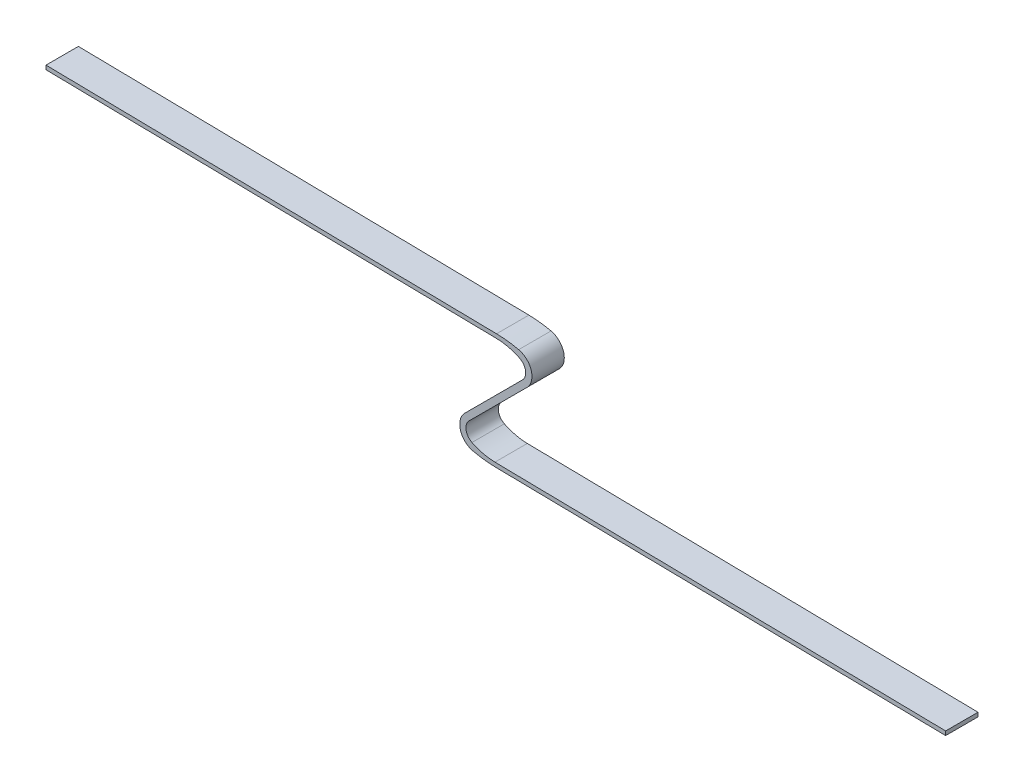
ISO-10303-21;
HEADER;
FILE_DESCRIPTION(('STEP AP214'),'2;1');
FILE_NAME('part.step','',(''),(''),'','','');
FILE_SCHEMA(('AUTOMOTIVE_DESIGN { 1 0 10303 214 1 1 1 1 }'));
ENDSEC;
DATA;
#1=APPLICATION_CONTEXT('core data for automotive mechanical design processes');
#2=APPLICATION_PROTOCOL_DEFINITION('international standard','automotive_design',2000,#1);
#3=PRODUCT_CONTEXT('',#1,'mechanical');
#4=PRODUCT('Part','Part','',(#3));
#5=PRODUCT_RELATED_PRODUCT_CATEGORY('part','',(#4));
#6=PRODUCT_DEFINITION_FORMATION('','',#4);
#7=PRODUCT_DEFINITION_CONTEXT('part definition',#1,'design');
#8=PRODUCT_DEFINITION('design','',#6,#7);
#9=PRODUCT_DEFINITION_SHAPE('','',#8);
#10=(LENGTH_UNIT() NAMED_UNIT(*) SI_UNIT(.MILLI.,.METRE.));
#11=(NAMED_UNIT(*) PLANE_ANGLE_UNIT() SI_UNIT($,.RADIAN.));
#12=(NAMED_UNIT(*) SI_UNIT($,.STERADIAN.) SOLID_ANGLE_UNIT());
#13=UNCERTAINTY_MEASURE_WITH_UNIT(LENGTH_MEASURE(1.E-05),#10,'distance_accuracy_value','');
#14=(GEOMETRIC_REPRESENTATION_CONTEXT(3) GLOBAL_UNCERTAINTY_ASSIGNED_CONTEXT((#13)) GLOBAL_UNIT_ASSIGNED_CONTEXT((#10,
#11,#12)) REPRESENTATION_CONTEXT('',''));
#15=CARTESIAN_POINT('',(0.,0.,0.));
#16=DIRECTION('',(0.,0.,1.));
#17=DIRECTION('',(1.,0.,0.));
#18=AXIS2_PLACEMENT_3D('',#15,#16,#17);
#19=CARTESIAN_POINT('',(3.53500880090639,7.17660872401751,29.5000000000005));
#20=DIRECTION('',(0.,0.,-1.));
#21=DIRECTION('',(-1.,0.,0.));
#22=AXIS2_PLACEMENT_3D('',#19,#20,#21);
#23=CYLINDRICAL_SURFACE('',#22,1.99999999999999);
#24=CARTESIAN_POINT('',(3.53500880090639,7.17660872401751,23.5000000000005));
#25=DIRECTION('',(0.,0.,-1.));
#26=DIRECTION('',(1.,0.,0.));
#27=AXIS2_PLACEMENT_3D('',#24,#25,#26);
#28=CIRCLE('',#27,1.99999999999999);
#29=CARTESIAN_POINT('',(4.41876100113213,8.97076090502004,23.5000000000005));
#30=VERTEX_POINT('',#29);
#31=CARTESIAN_POINT('',(4.94922236327948,5.76239516164443,23.5000000000005));
#32=VERTEX_POINT('',#31);
#33=EDGE_CURVE('E181',#30,#32,#28,.T.);
#34=ORIENTED_EDGE('',*,*,#33,.T.);
#35=DIRECTION('',(0.,0.,-1.));
#36=VECTOR('',#35,1.);
#37=CARTESIAN_POINT('',(4.94922236327948,5.76239516164443,29.5000000000005));
#38=LINE('',#37,#36);
#39=CARTESIAN_POINT('',(4.94922236327948,5.76239516164443,29.5000000000005));
#40=VERTEX_POINT('',#39);
#41=EDGE_CURVE('E11',#40,#32,#38,.T.);
#42=ORIENTED_EDGE('',*,*,#41,.F.);
#43=CARTESIAN_POINT('',(3.53500880090639,7.17660872401751,29.5000000000005));
#44=DIRECTION('',(0.,0.,-1.));
#45=DIRECTION('',(1.,0.,0.));
#46=AXIS2_PLACEMENT_3D('',#43,#44,#45);
#47=CIRCLE('',#46,1.99999999999999);
#48=CARTESIAN_POINT('',(4.41876100113213,8.97076090502004,29.5000000000005));
#49=VERTEX_POINT('',#48);
#50=EDGE_CURVE('E211',#49,#40,#47,.T.);
#51=ORIENTED_EDGE('',*,*,#50,.F.);
#52=DIRECTION('',(0.,0.,-1.));
#53=VECTOR('',#52,1.);
#54=CARTESIAN_POINT('',(4.41876100113213,8.97076090502004,29.5000000000005));
#55=LINE('',#54,#53);
#56=EDGE_CURVE('E177',#49,#30,#55,.T.);
#57=ORIENTED_EDGE('',*,*,#56,.T.);
#58=EDGE_LOOP('',(#34,#42,#51,#57));
#59=FACE_BOUND('',#58,.T.);
#60=ADVANCED_FACE('F37',(#59),#23,.F.);
#61=CARTESIAN_POINT('',(4.94922236327948,5.76239516164443,29.5000000000005));
#62=DIRECTION('',(0.707106781186548,-0.707106781186547,0.));
#63=DIRECTION('',(0.707106781186547,0.707106781186548,0.));
#64=AXIS2_PLACEMENT_3D('',#61,#62,#63);
#65=PLANE('',#64);
#66=DIRECTION('',(-0.707106781186547,-0.707106781186548,0.));
#67=VECTOR('',#66,1.);
#68=CARTESIAN_POINT('',(4.94922236327948,5.76239516164443,23.5000000000005));
#69=LINE('',#68,#67);
#70=CARTESIAN_POINT('',(-5.76239516164399,-4.94922236327907,23.5000000000005));
#71=VERTEX_POINT('',#70);
#72=EDGE_CURVE('E184',#32,#71,#69,.T.);
#73=ORIENTED_EDGE('',*,*,#72,.T.);
#74=DIRECTION('',(0.,0.,-1.));
#75=VECTOR('',#74,1.);
#76=CARTESIAN_POINT('',(-5.76239516164399,-4.94922236327907,29.5000000000005));
#77=LINE('',#76,#75);
#78=CARTESIAN_POINT('',(-5.76239516164399,-4.94922236327907,29.5000000000005));
#79=VERTEX_POINT('',#78);
#80=EDGE_CURVE('E45',#79,#71,#77,.T.);
#81=ORIENTED_EDGE('',*,*,#80,.F.);
#82=DIRECTION('',(-0.707106781186547,-0.707106781186548,0.));
#83=VECTOR('',#82,1.);
#84=CARTESIAN_POINT('',(4.94922236327948,5.76239516164443,29.5000000000005));
#85=LINE('',#84,#83);
#86=EDGE_CURVE('E120',#40,#79,#85,.T.);
#87=ORIENTED_EDGE('',*,*,#86,.F.);
#88=ORIENTED_EDGE('',*,*,#41,.T.);
#89=EDGE_LOOP('',(#73,#81,#87,#88));
#90=FACE_BOUND('',#89,.T.);
#91=ADVANCED_FACE('F309',(#90),#65,.F.);
#92=CARTESIAN_POINT('',(-3.53500880090639,-7.17660872401666,29.5000000000005));
#93=DIRECTION('',(0.,0.,-1.));
#94=DIRECTION('',(-1.,0.,0.));
#95=AXIS2_PLACEMENT_3D('',#92,#93,#94);
#96=CYLINDRICAL_SURFACE('',#95,3.14999999999997);
#97=CARTESIAN_POINT('',(-3.53500880090639,-7.17660872401666,23.5000000000005));
#98=DIRECTION('',(0.,0.,1.));
#99=DIRECTION('',(1.,0.,0.));
#100=AXIS2_PLACEMENT_3D('',#97,#98,#99);
#101=CIRCLE('',#100,3.14999999999997);
#102=CARTESIAN_POINT('',(-4.23868319076121,-10.2470064756219,23.5000000000005));
#103=VERTEX_POINT('',#102);
#104=EDGE_CURVE('E186',#71,#103,#101,.T.);
#105=ORIENTED_EDGE('',*,*,#104,.T.);
#106=DIRECTION('',(0.,0.,-1.));
#107=VECTOR('',#106,1.);
#108=CARTESIAN_POINT('',(-4.23868319076121,-10.2470064756219,29.5000000000005));
#109=LINE('',#108,#107);
#110=CARTESIAN_POINT('',(-4.23868319076121,-10.2470064756219,29.5000000000005));
#111=VERTEX_POINT('',#110);
#112=EDGE_CURVE('E242',#111,#103,#109,.T.);
#113=ORIENTED_EDGE('',*,*,#112,.F.);
#114=CARTESIAN_POINT('',(-3.53500880090639,-7.17660872401666,29.5000000000005));
#115=DIRECTION('',(0.,0.,1.));
#116=DIRECTION('',(1.,0.,0.));
#117=AXIS2_PLACEMENT_3D('',#114,#115,#116);
#118=CIRCLE('',#117,3.14999999999997);
#119=EDGE_CURVE('E250',#79,#111,#118,.T.);
#120=ORIENTED_EDGE('',*,*,#119,.F.);
#121=ORIENTED_EDGE('',*,*,#80,.T.);
#122=EDGE_LOOP('',(#105,#113,#120,#121));
#123=FACE_BOUND('',#122,.T.);
#124=ADVANCED_FACE('F248',(#123),#96,.T.);
#125=CARTESIAN_POINT('',(0.229090713078887,9.24758242345897,29.5000000000005));
#126=DIRECTION('',(0.,0.,-1.));
#127=DIRECTION('',(-1.,0.,0.));
#128=AXIS2_PLACEMENT_3D('',#125,#126,#127);
#129=CYLINDRICAL_SURFACE('',#128,20.);
#130=CARTESIAN_POINT('',(0.229090713078887,9.24758242345897,23.5000000000005));
#131=DIRECTION('',(0.,0.,1.));
#132=DIRECTION('',(1.,0.,0.));
#133=AXIS2_PLACEMENT_3D('',#130,#131,#132);
#134=CIRCLE('',#133,20.);
#135=CARTESIAN_POINT('',(-0.100471188172594,-10.749702116029,23.5000000000005));
#136=VERTEX_POINT('',#135);
#137=EDGE_CURVE('E188',#103,#136,#134,.T.);
#138=ORIENTED_EDGE('',*,*,#137,.T.);
#139=DIRECTION('',(0.,0.,-1.));
#140=VECTOR('',#139,1.);
#141=CARTESIAN_POINT('',(-0.100471188172594,-10.749702116029,29.5000000000005));
#142=LINE('',#141,#140);
#143=CARTESIAN_POINT('',(-0.100471188172594,-10.749702116029,29.5000000000005));
#144=VERTEX_POINT('',#143);
#145=EDGE_CURVE('E239',#144,#136,#142,.T.);
#146=ORIENTED_EDGE('',*,*,#145,.F.);
#147=CARTESIAN_POINT('',(0.229090713078887,9.24758242345897,29.5000000000005));
#148=DIRECTION('',(0.,0.,1.));
#149=DIRECTION('',(1.,0.,0.));
#150=AXIS2_PLACEMENT_3D('',#147,#148,#149);
#151=CIRCLE('',#150,20.);
#152=EDGE_CURVE('E268',#111,#144,#151,.T.);
#153=ORIENTED_EDGE('',*,*,#152,.F.);
#154=ORIENTED_EDGE('',*,*,#112,.T.);
#155=EDGE_LOOP('',(#138,#146,#153,#154));
#156=FACE_BOUND('',#155,.T.);
#157=ADVANCED_FACE('F259',(#156),#129,.T.);
#158=CARTESIAN_POINT('',(-0.100471188172594,-10.749702116029,29.5000000000005));
#159=DIRECTION('',(0.016478095062574,0.999864226974397,0.));
#160=DIRECTION('',(-0.999864226974397,0.016478095062574,0.));
#161=AXIS2_PLACEMENT_3D('',#158,#159,#160);
#162=PLANE('',#161);
#163=DIRECTION('',(0.999864226974397,-0.016478095062574,0.));
#164=VECTOR('',#163,1.);
#165=CARTESIAN_POINT('',(-0.100471188172594,-10.749702116029,23.5000000000005));
#166=LINE('',#165,#164);
#167=CARTESIAN_POINT('',(83.3503858679681,-12.1250000000082,23.5000000000005));
#168=VERTEX_POINT('',#167);
#169=EDGE_CURVE('E190',#136,#168,#166,.T.);
#170=ORIENTED_EDGE('',*,*,#169,.T.);
#171=DIRECTION('',(0.,0.,-1.));
#172=VECTOR('',#171,1.);
#173=CARTESIAN_POINT('',(83.3503858679681,-12.1250000000082,29.5000000000005));
#174=LINE('',#173,#172);
#175=CARTESIAN_POINT('',(83.3503858679681,-12.1250000000082,29.5000000000005));
#176=VERTEX_POINT('',#175);
#177=EDGE_CURVE('E236',#176,#168,#174,.T.);
#178=ORIENTED_EDGE('',*,*,#177,.F.);
#179=DIRECTION('',(0.999864226974397,-0.016478095062574,0.));
#180=VECTOR('',#179,1.);
#181=CARTESIAN_POINT('',(-0.100471188172594,-10.749702116029,29.5000000000005));
#182=LINE('',#181,#180);
#183=EDGE_CURVE('E265',#144,#176,#182,.T.);
#184=ORIENTED_EDGE('',*,*,#183,.F.);
#185=ORIENTED_EDGE('',*,*,#145,.T.);
#186=EDGE_LOOP('',(#170,#178,#184,#185));
#187=FACE_BOUND('',#186,.T.);
#188=ADVANCED_FACE('F263',(#187),#162,.F.);
#189=CARTESIAN_POINT('',(83.3503858679681,-12.1250000000082,29.5000000000005));
#190=DIRECTION('',(-1.,0.,0.));
#191=DIRECTION('',(0.,0.,1.));
#192=AXIS2_PLACEMENT_3D('',#189,#190,#191);
#193=PLANE('',#192);
#194=DIRECTION('',(0.,1.,0.));
#195=VECTOR('',#194,1.);
#196=CARTESIAN_POINT('',(83.3503858679681,-12.1250000000082,23.5000000000005));
#197=LINE('',#196,#195);
#198=CARTESIAN_POINT('',(83.3503858679681,-11.3750000000082,23.5000000000005));
#199=VERTEX_POINT('',#198);
#200=EDGE_CURVE('E192',#168,#199,#197,.T.);
#201=ORIENTED_EDGE('',*,*,#200,.T.);
#202=DIRECTION('',(0.,0.,-1.));
#203=VECTOR('',#202,1.);
#204=CARTESIAN_POINT('',(83.3503858679681,-11.3750000000082,29.5000000000005));
#205=LINE('',#204,#203);
#206=CARTESIAN_POINT('',(83.3503858679681,-11.3750000000082,29.5000000000005));
#207=VERTEX_POINT('',#206);
#208=EDGE_CURVE('E233',#207,#199,#205,.T.);
#209=ORIENTED_EDGE('',*,*,#208,.F.);
#210=DIRECTION('',(0.,1.,0.));
#211=VECTOR('',#210,1.);
#212=CARTESIAN_POINT('',(83.3503858679681,-12.1250000000082,29.5000000000005));
#213=LINE('',#212,#211);
#214=EDGE_CURVE('E267',#176,#207,#213,.T.);
#215=ORIENTED_EDGE('',*,*,#214,.F.);
#216=ORIENTED_EDGE('',*,*,#177,.T.);
#217=EDGE_LOOP('',(#201,#209,#215,#216));
#218=FACE_BOUND('',#217,.T.);
#219=ADVANCED_FACE('F322',(#218),#193,.F.);
#220=CARTESIAN_POINT('',(-0.164780950625868,-9.99864226975129,29.5000000000005));
#221=DIRECTION('',(-0.016478095062574,-0.999864226974397,0.));
#222=DIRECTION('',(0.999864226974397,-0.016478095062574,0.));
#223=AXIS2_PLACEMENT_3D('',#220,#221,#222);
#224=PLANE('',#223);
#225=DIRECTION('',(-0.999864226974397,0.016478095062574,0.));
#226=VECTOR('',#225,1.);
#227=CARTESIAN_POINT('',(-0.164780950625868,-9.99864226975129,23.5000000000005));
#228=LINE('',#227,#226);
#229=CARTESIAN_POINT('',(-0.164780950625871,-9.99864226975128,23.5000000000005));
#230=VERTEX_POINT('',#229);
#231=EDGE_CURVE('E194',#199,#230,#228,.T.);
#232=ORIENTED_EDGE('',*,*,#231,.T.);
#233=DIRECTION('',(0.,0.,-1.));
#234=VECTOR('',#233,1.);
#235=CARTESIAN_POINT('',(-0.164780950625871,-9.99864226975128,29.5000000000005));
#236=LINE('',#235,#234);
#237=CARTESIAN_POINT('',(-0.164780950625871,-9.99864226975128,29.5000000000005));
#238=VERTEX_POINT('',#237);
#239=EDGE_CURVE('E230',#238,#230,#236,.T.);
#240=ORIENTED_EDGE('',*,*,#239,.F.);
#241=DIRECTION('',(-0.999864226974397,0.016478095062574,0.));
#242=VECTOR('',#241,1.);
#243=CARTESIAN_POINT('',(-0.164780950625868,-9.99864226975129,29.5000000000005));
#244=LINE('',#243,#242);
#245=EDGE_CURVE('E270',#207,#238,#244,.T.);
#246=ORIENTED_EDGE('',*,*,#245,.F.);
#247=ORIENTED_EDGE('',*,*,#208,.T.);
#248=EDGE_LOOP('',(#232,#240,#246,#247));
#249=FACE_BOUND('',#248,.T.);
#250=ADVANCED_FACE('F325',(#249),#224,.F.);
#251=CARTESIAN_POINT('',(0.,4.21016101940819E-13,29.5000000000005));
#252=DIRECTION('',(0.,0.,-1.));
#253=DIRECTION('',(-1.,0.,0.));
#254=AXIS2_PLACEMENT_3D('',#251,#252,#253);
#255=CYLINDRICAL_SURFACE('',#254,10.0000000000077);
#256=CARTESIAN_POINT('',(0.,4.21016101940819E-13,23.5000000000005));
#257=DIRECTION('',(0.,0.,-1.));
#258=DIRECTION('',(1.,0.,0.));
#259=AXIS2_PLACEMENT_3D('',#256,#257,#258);
#260=CIRCLE('',#259,10.0000000000077);
#261=CARTESIAN_POINT('',(-4.41876100113213,-8.97076090501919,23.5000000000005));
#262=VERTEX_POINT('',#261);
#263=EDGE_CURVE('E196',#230,#262,#260,.T.);
#264=ORIENTED_EDGE('',*,*,#263,.T.);
#265=DIRECTION('',(0.,0.,-1.));
#266=VECTOR('',#265,1.);
#267=CARTESIAN_POINT('',(-4.41876100113213,-8.97076090501919,29.5000000000005));
#268=LINE('',#267,#266);
#269=CARTESIAN_POINT('',(-4.41876100113213,-8.97076090501919,29.5000000000005));
#270=VERTEX_POINT('',#269);
#271=EDGE_CURVE('E227',#270,#262,#268,.T.);
#272=ORIENTED_EDGE('',*,*,#271,.F.);
#273=CARTESIAN_POINT('',(0.,4.21016101940819E-13,29.5000000000005));
#274=DIRECTION('',(0.,0.,-1.));
#275=DIRECTION('',(1.,0.,0.));
#276=AXIS2_PLACEMENT_3D('',#273,#274,#275);
#277=CIRCLE('',#276,10.0000000000077);
#278=EDGE_CURVE('E276',#238,#270,#277,.T.);
#279=ORIENTED_EDGE('',*,*,#278,.F.);
#280=ORIENTED_EDGE('',*,*,#239,.T.);
#281=EDGE_LOOP('',(#264,#272,#279,#280));
#282=FACE_BOUND('',#281,.T.);
#283=ADVANCED_FACE('F329',(#282),#255,.F.);
#284=CARTESIAN_POINT('',(-3.53500880090639,-7.17660872401666,29.5000000000005));
#285=DIRECTION('',(0.,0.,-1.));
#286=DIRECTION('',(-1.,0.,0.));
#287=AXIS2_PLACEMENT_3D('',#284,#285,#286);
#288=CYLINDRICAL_SURFACE('',#287,1.99999999999999);
#289=CARTESIAN_POINT('',(-3.53500880090639,-7.17660872401666,23.5000000000005));
#290=DIRECTION('',(0.,0.,-1.));
#291=DIRECTION('',(1.,0.,0.));
#292=AXIS2_PLACEMENT_3D('',#289,#290,#291);
#293=CIRCLE('',#292,1.99999999999999);
#294=CARTESIAN_POINT('',(-4.94922236327947,-5.76239516164357,23.5000000000005));
#295=VERTEX_POINT('',#294);
#296=EDGE_CURVE('E198',#262,#295,#293,.T.);
#297=ORIENTED_EDGE('',*,*,#296,.T.);
#298=DIRECTION('',(0.,0.,-1.));
#299=VECTOR('',#298,1.);
#300=CARTESIAN_POINT('',(-4.94922236327947,-5.76239516164357,29.5000000000005));
#301=LINE('',#300,#299);
#302=CARTESIAN_POINT('',(-4.94922236327947,-5.76239516164357,29.5000000000005));
#303=VERTEX_POINT('',#302);
#304=EDGE_CURVE('E224',#303,#295,#301,.T.);
#305=ORIENTED_EDGE('',*,*,#304,.F.);
#306=CARTESIAN_POINT('',(-3.53500880090639,-7.17660872401666,29.5000000000005));
#307=DIRECTION('',(0.,0.,-1.));
#308=DIRECTION('',(1.,0.,0.));
#309=AXIS2_PLACEMENT_3D('',#306,#307,#308);
#310=CIRCLE('',#309,1.99999999999999);
#311=EDGE_CURVE('E278',#270,#303,#310,.T.);
#312=ORIENTED_EDGE('',*,*,#311,.F.);
#313=ORIENTED_EDGE('',*,*,#271,.T.);
#314=EDGE_LOOP('',(#297,#305,#312,#313));
#315=FACE_BOUND('',#314,.T.);
#316=ADVANCED_FACE('F333',(#315),#288,.F.);
#317=CARTESIAN_POINT('',(-4.94922236327947,-5.76239516164357,29.5000000000005));
#318=DIRECTION('',(-0.707106781186547,0.707106781186548,0.));
#319=DIRECTION('',(-0.707106781186548,-0.707106781186547,0.));
#320=AXIS2_PLACEMENT_3D('',#317,#318,#319);
#321=PLANE('',#320);
#322=DIRECTION('',(0.707106781186548,0.707106781186547,0.));
#323=VECTOR('',#322,1.);
#324=CARTESIAN_POINT('',(-4.94922236327947,-5.76239516164357,23.5000000000005));
#325=LINE('',#324,#323);
#326=CARTESIAN_POINT('',(5.88946319449754,5.07629039613343,23.5000000000005));
#327=VERTEX_POINT('',#326);
#328=EDGE_CURVE('E200',#295,#327,#325,.T.);
#329=ORIENTED_EDGE('',*,*,#328,.T.);
#330=DIRECTION('',(0.,0.,-1.));
#331=VECTOR('',#330,1.);
#332=CARTESIAN_POINT('',(5.88946319449754,5.07629039613343,29.5000000000005));
#333=LINE('',#332,#331);
#334=CARTESIAN_POINT('',(5.88946319449754,5.07629039613343,29.5000000000005));
#335=VERTEX_POINT('',#334);
#336=EDGE_CURVE('E221',#335,#327,#333,.T.);
#337=ORIENTED_EDGE('',*,*,#336,.F.);
#338=DIRECTION('',(0.707106781186548,0.707106781186547,0.));
#339=VECTOR('',#338,1.);
#340=CARTESIAN_POINT('',(-4.94922236327947,-5.76239516164357,29.5000000000005));
#341=LINE('',#340,#339);
#342=EDGE_CURVE('E280',#303,#335,#341,.T.);
#343=ORIENTED_EDGE('',*,*,#342,.F.);
#344=ORIENTED_EDGE('',*,*,#304,.T.);
#345=EDGE_LOOP('',(#329,#337,#343,#344));
#346=FACE_BOUND('',#345,.T.);
#347=ADVANCED_FACE('F337',(#346),#321,.F.);
#348=CARTESIAN_POINT('',(3.53500880090639,7.17660872401751,29.5000000000005));
#349=DIRECTION('',(0.,0.,-1.));
#350=DIRECTION('',(-1.,0.,0.));
#351=AXIS2_PLACEMENT_3D('',#348,#349,#350);
#352=CYLINDRICAL_SURFACE('',#351,3.15512164106971);
#353=CARTESIAN_POINT('',(3.53500880090639,7.17660872401751,23.5000000000005));
#354=DIRECTION('',(0.,0.,1.));
#355=DIRECTION('',(1.,0.,0.));
#356=AXIS2_PLACEMENT_3D('',#353,#354,#355);
#357=CIRCLE('',#356,3.15512164106971);
#358=CARTESIAN_POINT('',(4.23419131379584,10.2532849149118,23.5000000000005));
#359=VERTEX_POINT('',#358);
#360=EDGE_CURVE('E202',#327,#359,#357,.T.);
#361=ORIENTED_EDGE('',*,*,#360,.T.);
#362=DIRECTION('',(0.,0.,-1.));
#363=VECTOR('',#362,1.);
#364=CARTESIAN_POINT('',(4.23419131379584,10.2532849149118,29.5000000000005));
#365=LINE('',#364,#363);
#366=CARTESIAN_POINT('',(4.23419131379584,10.2532849149118,29.5000000000005));
#367=VERTEX_POINT('',#366);
#368=EDGE_CURVE('E218',#367,#359,#365,.T.);
#369=ORIENTED_EDGE('',*,*,#368,.F.);
#370=CARTESIAN_POINT('',(3.53500880090639,7.17660872401751,29.5000000000005));
#371=DIRECTION('',(0.,0.,1.));
#372=DIRECTION('',(1.,0.,0.));
#373=AXIS2_PLACEMENT_3D('',#370,#371,#372);
#374=CIRCLE('',#373,3.15512164106971);
#375=EDGE_CURVE('E282',#335,#367,#374,.T.);
#376=ORIENTED_EDGE('',*,*,#375,.F.);
#377=ORIENTED_EDGE('',*,*,#336,.T.);
#378=EDGE_LOOP('',(#361,#369,#376,#377));
#379=FACE_BOUND('',#378,.T.);
#380=ADVANCED_FACE('F341',(#379),#352,.T.);
#381=CARTESIAN_POINT('',(-0.197856590717955,-9.24945723515761,29.5000000000005));
#382=DIRECTION('',(0.,0.,-1.));
#383=DIRECTION('',(-1.,0.,0.));
#384=AXIS2_PLACEMENT_3D('',#381,#382,#383);
#385=CYLINDRICAL_SURFACE('',#384,20.);
#386=CARTESIAN_POINT('',(-0.197856590717955,-9.24945723515761,23.5000000000005));
#387=DIRECTION('',(0.,0.,1.));
#388=DIRECTION('',(1.,0.,0.));
#389=AXIS2_PLACEMENT_3D('',#386,#387,#388);
#390=CIRCLE('',#389,20.);
#391=CARTESIAN_POINT('',(0.132031010536735,10.7478219340328,23.5000000000005));
#392=VERTEX_POINT('',#391);
#393=EDGE_CURVE('E204',#359,#392,#390,.T.);
#394=ORIENTED_EDGE('',*,*,#393,.T.);
#395=DIRECTION('',(0.,0.,-1.));
#396=VECTOR('',#395,1.);
#397=CARTESIAN_POINT('',(0.132031010536735,10.7478219340328,29.5000000000005));
#398=LINE('',#397,#396);
#399=CARTESIAN_POINT('',(0.132031010536735,10.7478219340328,29.5000000000005));
#400=VERTEX_POINT('',#399);
#401=EDGE_CURVE('E215',#400,#392,#398,.T.);
#402=ORIENTED_EDGE('',*,*,#401,.F.);
#403=CARTESIAN_POINT('',(-0.197856590717955,-9.24945723515761,29.5000000000005));
#404=DIRECTION('',(0.,0.,1.));
#405=DIRECTION('',(1.,0.,0.));
#406=AXIS2_PLACEMENT_3D('',#403,#404,#405);
#407=CIRCLE('',#406,20.);
#408=EDGE_CURVE('E284',#367,#400,#407,.T.);
#409=ORIENTED_EDGE('',*,*,#408,.F.);
#410=ORIENTED_EDGE('',*,*,#368,.T.);
#411=EDGE_LOOP('',(#394,#402,#409,#410));
#412=FACE_BOUND('',#411,.T.);
#413=ADVANCED_FACE('F290',(#412),#385,.T.);
#414=CARTESIAN_POINT('',(0.132031010536735,10.7478219340328,29.5000000000005));
#415=DIRECTION('',(-0.0164943800627346,-0.999863958459523,0.));
#416=DIRECTION('',(0.999863958459523,-0.0164943800627346,0.));
#417=AXIS2_PLACEMENT_3D('',#414,#415,#416);
#418=PLANE('',#417);
#419=DIRECTION('',(-0.999863958459523,0.0164943800627346,0.));
#420=VECTOR('',#419,1.);
#421=CARTESIAN_POINT('',(0.132031010536735,10.7478219340328,23.5000000000005));
#422=LINE('',#421,#420);
#423=CARTESIAN_POINT('',(-83.3503858679681,12.1250000000082,23.5000000000005));
#424=VERTEX_POINT('',#423);
#425=EDGE_CURVE('E206',#392,#424,#422,.T.);
#426=ORIENTED_EDGE('',*,*,#425,.T.);
#427=DIRECTION('',(0.,0.,-1.));
#428=VECTOR('',#427,1.);
#429=CARTESIAN_POINT('',(-83.3503858679681,12.1250000000082,29.5000000000005));
#430=LINE('',#429,#428);
#431=CARTESIAN_POINT('',(-83.3503858679681,12.1250000000082,29.5000000000005));
#432=VERTEX_POINT('',#431);
#433=EDGE_CURVE('E172',#432,#424,#430,.T.);
#434=ORIENTED_EDGE('',*,*,#433,.F.);
#435=DIRECTION('',(-0.999863958459523,0.0164943800627346,0.));
#436=VECTOR('',#435,1.);
#437=CARTESIAN_POINT('',(0.132031010536735,10.7478219340328,29.5000000000005));
#438=LINE('',#437,#436);
#439=EDGE_CURVE('E163',#400,#432,#438,.T.);
#440=ORIENTED_EDGE('',*,*,#439,.F.);
#441=ORIENTED_EDGE('',*,*,#401,.T.);
#442=EDGE_LOOP('',(#426,#434,#440,#441));
#443=FACE_BOUND('',#442,.T.);
#444=ADVANCED_FACE('F294',(#443),#418,.F.);
#445=CARTESIAN_POINT('',(-83.3503858679681,12.1250000000082,29.5000000000005));
#446=DIRECTION('',(1.,0.,0.));
#447=DIRECTION('',(0.,0.,-1.));
#448=AXIS2_PLACEMENT_3D('',#445,#446,#447);
#449=PLANE('',#448);
#450=DIRECTION('',(0.,-1.,0.));
#451=VECTOR('',#450,1.);
#452=CARTESIAN_POINT('',(-83.3503858679681,12.1250000000082,23.5000000000005));
#453=LINE('',#452,#451);
#454=CARTESIAN_POINT('',(-83.3503858679681,11.3750000000082,23.5000000000005));
#455=VERTEX_POINT('',#454);
#456=EDGE_CURVE('E171',#424,#455,#453,.T.);
#457=ORIENTED_EDGE('',*,*,#456,.T.);
#458=DIRECTION('',(0.,0.,-1.));
#459=VECTOR('',#458,1.);
#460=CARTESIAN_POINT('',(-83.3503858679681,11.3750000000082,29.5000000000005));
#461=LINE('',#460,#459);
#462=CARTESIAN_POINT('',(-83.3503858679681,11.3750000000082,29.5000000000005));
#463=VERTEX_POINT('',#462);
#464=EDGE_CURVE('E168',#463,#455,#461,.T.);
#465=ORIENTED_EDGE('',*,*,#464,.F.);
#466=DIRECTION('',(0.,-1.,0.));
#467=VECTOR('',#466,1.);
#468=CARTESIAN_POINT('',(-83.3503858679681,12.1250000000082,29.5000000000005));
#469=LINE('',#468,#467);
#470=EDGE_CURVE('E157',#432,#463,#469,.T.);
#471=ORIENTED_EDGE('',*,*,#470,.F.);
#472=ORIENTED_EDGE('',*,*,#433,.T.);
#473=EDGE_LOOP('',(#457,#465,#471,#472));
#474=FACE_BOUND('',#473,.T.);
#475=ADVANCED_FACE('F169',(#474),#449,.F.);
#476=CARTESIAN_POINT('',(0.,10.0000000000082,29.5000000000005));
#477=DIRECTION('',(0.0164943800627345,0.999863958459522,0.));
#478=DIRECTION('',(-0.999863958459523,0.0164943800627345,0.));
#479=AXIS2_PLACEMENT_3D('',#476,#477,#478);
#480=PLANE('',#479);
#481=DIRECTION('',(0.999863958459523,-0.0164943800627345,0.));
#482=VECTOR('',#481,1.);
#483=CARTESIAN_POINT('',(0.,10.0000000000082,23.5000000000005));
#484=LINE('',#483,#482);
#485=CARTESIAN_POINT('',(0.,10.0000000000082,23.5000000000005));
#486=VERTEX_POINT('',#485);
#487=EDGE_CURVE('E106',#455,#486,#484,.T.);
#488=ORIENTED_EDGE('',*,*,#487,.T.);
#489=DIRECTION('',(0.,0.,-1.));
#490=VECTOR('',#489,1.);
#491=CARTESIAN_POINT('',(0.,10.0000000000082,29.5000000000005));
#492=LINE('',#491,#490);
#493=CARTESIAN_POINT('',(0.,10.0000000000082,29.5000000000005));
#494=VERTEX_POINT('',#493);
#495=EDGE_CURVE('E173',#494,#486,#492,.T.);
#496=ORIENTED_EDGE('',*,*,#495,.F.);
#497=DIRECTION('',(0.999863958459523,-0.0164943800627345,0.));
#498=VECTOR('',#497,1.);
#499=CARTESIAN_POINT('',(0.,10.0000000000082,29.5000000000005));
#500=LINE('',#499,#498);
#501=EDGE_CURVE('E161',#463,#494,#500,.T.);
#502=ORIENTED_EDGE('',*,*,#501,.F.);
#503=ORIENTED_EDGE('',*,*,#464,.T.);
#504=EDGE_LOOP('',(#488,#496,#502,#503));
#505=FACE_BOUND('',#504,.T.);
#506=ADVANCED_FACE('F175',(#505),#480,.F.);
#507=CARTESIAN_POINT('',(0.,4.21016101940819E-13,29.5000000000005));
#508=DIRECTION('',(0.,0.,-1.));
#509=DIRECTION('',(-1.,0.,0.));
#510=AXIS2_PLACEMENT_3D('',#507,#508,#509);
#511=CYLINDRICAL_SURFACE('',#510,10.0000000000077);
#512=CARTESIAN_POINT('',(0.,4.21016101940819E-13,23.5000000000005));
#513=DIRECTION('',(0.,0.,-1.));
#514=DIRECTION('',(1.,0.,0.));
#515=AXIS2_PLACEMENT_3D('',#512,#513,#514);
#516=CIRCLE('',#515,10.0000000000077);
#517=EDGE_CURVE('E112',#486,#30,#516,.T.);
#518=ORIENTED_EDGE('',*,*,#517,.T.);
#519=ORIENTED_EDGE('',*,*,#56,.F.);
#520=CARTESIAN_POINT('',(0.,4.21016101940819E-13,29.5000000000005));
#521=DIRECTION('',(0.,0.,-1.));
#522=DIRECTION('',(1.,0.,0.));
#523=AXIS2_PLACEMENT_3D('',#520,#521,#522);
#524=CIRCLE('',#523,10.0000000000077);
#525=EDGE_CURVE('E53',#494,#49,#524,.T.);
#526=ORIENTED_EDGE('',*,*,#525,.F.);
#527=ORIENTED_EDGE('',*,*,#495,.T.);
#528=EDGE_LOOP('',(#518,#519,#526,#527));
#529=FACE_BOUND('',#528,.T.);
#530=ADVANCED_FACE('F298',(#529),#511,.F.);
#531=CARTESIAN_POINT('',(3.53500880090639,7.17660872401751,29.5000000000005));
#532=DIRECTION('',(0.,0.,1.));
#533=DIRECTION('',(1.,0.,0.));
#534=AXIS2_PLACEMENT_3D('',#531,#532,#533);
#535=PLANE('',#534);
#536=ORIENTED_EDGE('',*,*,#50,.T.);
#537=ORIENTED_EDGE('',*,*,#86,.T.);
#538=ORIENTED_EDGE('',*,*,#119,.T.);
#539=ORIENTED_EDGE('',*,*,#152,.T.);
#540=ORIENTED_EDGE('',*,*,#183,.T.);
#541=ORIENTED_EDGE('',*,*,#214,.T.);
#542=ORIENTED_EDGE('',*,*,#245,.T.);
#543=ORIENTED_EDGE('',*,*,#278,.T.);
#544=ORIENTED_EDGE('',*,*,#311,.T.);
#545=ORIENTED_EDGE('',*,*,#342,.T.);
#546=ORIENTED_EDGE('',*,*,#375,.T.);
#547=ORIENTED_EDGE('',*,*,#408,.T.);
#548=ORIENTED_EDGE('',*,*,#439,.T.);
#549=ORIENTED_EDGE('',*,*,#470,.T.);
#550=ORIENTED_EDGE('',*,*,#501,.T.);
#551=ORIENTED_EDGE('',*,*,#525,.T.);
#552=EDGE_LOOP('',(#536,#537,#538,#539,#540,#541,#542,#543,#544,#545,#546,#547,#548,#549,#550,#551));
#553=FACE_BOUND('',#552,.T.);
#554=ADVANCED_FACE('F159',(#553),#535,.T.);
#555=CARTESIAN_POINT('',(3.53500880090639,7.17660872401751,23.5000000000005));
#556=DIRECTION('',(0.,0.,1.));
#557=DIRECTION('',(1.,0.,0.));
#558=AXIS2_PLACEMENT_3D('',#555,#556,#557);
#559=PLANE('',#558);
#560=ORIENTED_EDGE('',*,*,#33,.F.);
#561=ORIENTED_EDGE('',*,*,#517,.F.);
#562=ORIENTED_EDGE('',*,*,#487,.F.);
#563=ORIENTED_EDGE('',*,*,#456,.F.);
#564=ORIENTED_EDGE('',*,*,#425,.F.);
#565=ORIENTED_EDGE('',*,*,#393,.F.);
#566=ORIENTED_EDGE('',*,*,#360,.F.);
#567=ORIENTED_EDGE('',*,*,#328,.F.);
#568=ORIENTED_EDGE('',*,*,#296,.F.);
#569=ORIENTED_EDGE('',*,*,#263,.F.);
#570=ORIENTED_EDGE('',*,*,#231,.F.);
#571=ORIENTED_EDGE('',*,*,#200,.F.);
#572=ORIENTED_EDGE('',*,*,#169,.F.);
#573=ORIENTED_EDGE('',*,*,#137,.F.);
#574=ORIENTED_EDGE('',*,*,#104,.F.);
#575=ORIENTED_EDGE('',*,*,#72,.F.);
#576=EDGE_LOOP('',(#560,#561,#562,#563,#564,#565,#566,#567,#568,#569,#570,#571,#572,#573,#574,#575));
#577=FACE_BOUND('',#576,.T.);
#578=ADVANCED_FACE('F254',(#577),#559,.F.);
#579=CLOSED_SHELL('',(#60,#91,#124,#157,#188,#219,#250,#283,#316,#347,#380,#413,#444,#475,#506,
#530,#554,#578));
#580=MANIFOLD_SOLID_BREP('B2',#579);
#581=ADVANCED_BREP_SHAPE_REPRESENTATION('',(#18,#580),#14);
#582=SHAPE_DEFINITION_REPRESENTATION(#9,#581);
ENDSEC;
END-ISO-10303-21;
